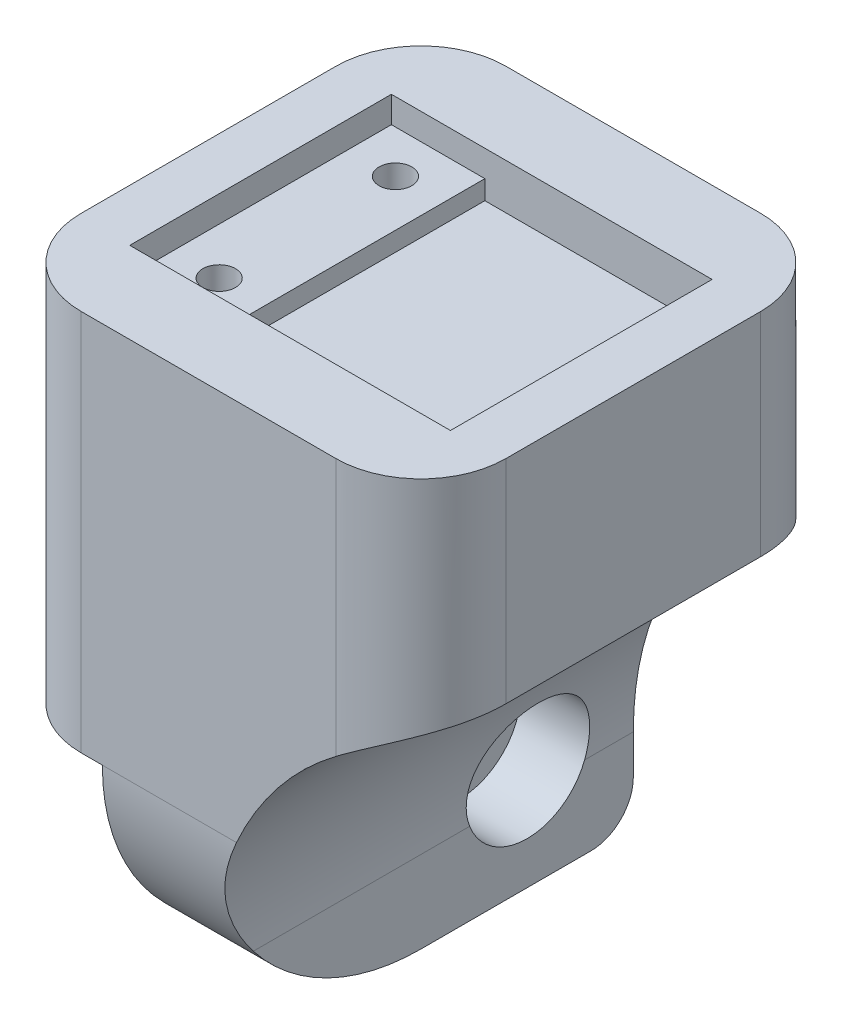
ISO-10303-21;
HEADER;
FILE_DESCRIPTION(('STEP AP214'),'2;1');
FILE_NAME('part.step','',(''),(''),'','','');
FILE_SCHEMA(('AUTOMOTIVE_DESIGN { 1 0 10303 214 1 1 1 1 }'));
ENDSEC;
DATA;
#1=APPLICATION_CONTEXT('core data for automotive mechanical design processes');
#2=APPLICATION_PROTOCOL_DEFINITION('international standard','automotive_design',2000,#1);
#3=PRODUCT_CONTEXT('',#1,'mechanical');
#4=PRODUCT('Part','Part','',(#3));
#5=PRODUCT_RELATED_PRODUCT_CATEGORY('part','',(#4));
#6=PRODUCT_DEFINITION_FORMATION('','',#4);
#7=PRODUCT_DEFINITION_CONTEXT('part definition',#1,'design');
#8=PRODUCT_DEFINITION('design','',#6,#7);
#9=PRODUCT_DEFINITION_SHAPE('','',#8);
#10=(LENGTH_UNIT() NAMED_UNIT(*) SI_UNIT(.MILLI.,.METRE.));
#11=(NAMED_UNIT(*) PLANE_ANGLE_UNIT() SI_UNIT($,.RADIAN.));
#12=(NAMED_UNIT(*) SI_UNIT($,.STERADIAN.) SOLID_ANGLE_UNIT());
#13=UNCERTAINTY_MEASURE_WITH_UNIT(LENGTH_MEASURE(1.E-05),#10,'distance_accuracy_value','');
#14=(GEOMETRIC_REPRESENTATION_CONTEXT(3) GLOBAL_UNCERTAINTY_ASSIGNED_CONTEXT((#13)) GLOBAL_UNIT_ASSIGNED_CONTEXT((#10,
#11,#12)) REPRESENTATION_CONTEXT('',''));
#15=CARTESIAN_POINT('',(0.,0.,0.));
#16=DIRECTION('',(0.,0.,1.));
#17=DIRECTION('',(1.,0.,0.));
#18=AXIS2_PLACEMENT_3D('',#15,#16,#17);
#19=CARTESIAN_POINT('',(6.35000000000001,-6.477,-6.35));
#20=DIRECTION('',(-1.,0.,0.));
#21=DIRECTION('',(0.,-1.,0.));
#22=AXIS2_PLACEMENT_3D('',#19,#20,#21);
#23=CYLINDRICAL_SURFACE('',#22,2.159);
#24=CARTESIAN_POINT('',(0.,-6.477,-6.35));
#25=DIRECTION('',(-1.,0.,0.));
#26=DIRECTION('',(0.,-1.,0.));
#27=AXIS2_PLACEMENT_3D('',#24,#25,#26);
#28=CIRCLE('',#27,2.159);
#29=CARTESIAN_POINT('',(0.,-8.636,-6.35));
#30=VERTEX_POINT('',#29);
#31=EDGE_CURVE('E251',#30,#30,#28,.T.);
#32=ORIENTED_EDGE('',*,*,#31,.T.);
#33=EDGE_LOOP('',(#32));
#34=FACE_BOUND('',#33,.T.);
#35=CARTESIAN_POINT('',(2.286,-6.477,-6.35));
#36=DIRECTION('',(1.,0.,0.));
#37=DIRECTION('',(0.,1.,0.));
#38=AXIS2_PLACEMENT_3D('',#35,#36,#37);
#39=CIRCLE('',#38,2.159);
#40=CARTESIAN_POINT('',(2.286,-4.318,-6.35));
#41=VERTEX_POINT('',#40);
#42=EDGE_CURVE('E244',#41,#41,#39,.T.);
#43=ORIENTED_EDGE('',*,*,#42,.T.);
#44=EDGE_LOOP('',(#43));
#45=FACE_BOUND('',#44,.T.);
#46=ADVANCED_FACE('F37',(#34,#45),#23,.F.);
#47=CARTESIAN_POINT('',(6.35,0.,12.7));
#48=DIRECTION('',(1.,0.,0.));
#49=DIRECTION('',(0.,1.,0.));
#50=AXIS2_PLACEMENT_3D('',#47,#48,#49);
#51=PLANE('',#50);
#52=DIRECTION('',(0.,0.,-1.));
#53=VECTOR('',#52,1.);
#54=CARTESIAN_POINT('',(6.35,-12.7,12.7));
#55=LINE('',#54,#53);
#56=CARTESIAN_POINT('',(6.35,-12.7,0.));
#57=VERTEX_POINT('',#56);
#58=CARTESIAN_POINT('',(6.35,-12.7,-10.16));
#59=VERTEX_POINT('',#58);
#60=EDGE_CURVE('E264',#57,#59,#55,.T.);
#61=ORIENTED_EDGE('',*,*,#60,.T.);
#62=CARTESIAN_POINT('',(6.35,-10.16,-10.16));
#63=DIRECTION('',(1.,0.,0.));
#64=DIRECTION('',(0.,1.,0.));
#65=AXIS2_PLACEMENT_3D('',#62,#63,#64);
#66=CIRCLE('',#65,2.54);
#67=CARTESIAN_POINT('',(6.35,-10.16,-12.7));
#68=VERTEX_POINT('',#67);
#69=EDGE_CURVE('E59',#59,#68,#66,.T.);
#70=ORIENTED_EDGE('',*,*,#69,.T.);
#71=DIRECTION('',(0.,-1.,0.));
#72=VECTOR('',#71,1.);
#73=CARTESIAN_POINT('',(6.35,0.,-12.7));
#74=LINE('',#73,#72);
#75=CARTESIAN_POINT('',(6.35,-7.80051224213831,-12.7));
#76=VERTEX_POINT('',#75);
#77=EDGE_CURVE('E256',#76,#68,#74,.T.);
#78=ORIENTED_EDGE('',*,*,#77,.F.);
#79=DIRECTION('',(0.,0.,1.));
#80=VECTOR('',#79,1.);
#81=CARTESIAN_POINT('',(6.35,-7.80051224213831,12.7));
#82=LINE('',#81,#80);
#83=CARTESIAN_POINT('',(6.35,-7.80051224213831,-9.78697604660115));
#84=VERTEX_POINT('',#83);
#85=EDGE_CURVE('E288',#76,#84,#82,.T.);
#86=ORIENTED_EDGE('',*,*,#85,.T.);
#87=CARTESIAN_POINT('',(6.35,-6.477,-6.35));
#88=DIRECTION('',(1.,0.,0.));
#89=DIRECTION('',(0.,1.,0.));
#90=AXIS2_PLACEMENT_3D('',#87,#88,#89);
#91=CIRCLE('',#90,3.683);
#92=CARTESIAN_POINT('',(6.35,-7.80051224213831,-2.91302395339885));
#93=VERTEX_POINT('',#92);
#94=EDGE_CURVE('E247',#93,#84,#91,.T.);
#95=ORIENTED_EDGE('',*,*,#94,.F.);
#96=DIRECTION('',(0.,0.,1.));
#97=VECTOR('',#96,1.);
#98=CARTESIAN_POINT('',(6.35,-7.80051224213831,12.7));
#99=LINE('',#98,#97);
#100=CARTESIAN_POINT('',(6.35,-7.80051224213831,10.0220760703684));
#101=VERTEX_POINT('',#100);
#102=EDGE_CURVE('E285',#93,#101,#99,.T.);
#103=ORIENTED_EDGE('',*,*,#102,.T.);
#104=CARTESIAN_POINT('',(6.35,0.,0.));
#105=DIRECTION('',(1.,0.,0.));
#106=DIRECTION('',(0.,1.,0.));
#107=AXIS2_PLACEMENT_3D('',#104,#105,#106);
#108=CIRCLE('',#107,12.7);
#109=EDGE_CURVE('E361',#101,#57,#108,.T.);
#110=ORIENTED_EDGE('',*,*,#109,.T.);
#111=EDGE_LOOP('',(#61,#70,#78,#86,#95,#103,#110));
#112=FACE_BOUND('',#111,.T.);
#113=ADVANCED_FACE('F314',(#112),#51,.T.);
#114=CARTESIAN_POINT('',(0.,22.86,12.7));
#115=DIRECTION('',(0.,1.,0.));
#116=DIRECTION('',(0.,0.,1.));
#117=AXIS2_PLACEMENT_3D('',#114,#115,#116);
#118=PLANE('',#117);
#119=DIRECTION('',(0.,0.,1.));
#120=VECTOR('',#119,1.);
#121=CARTESIAN_POINT('',(-3.23850000000001,22.86,-7.8232));
#122=LINE('',#121,#120);
#123=CARTESIAN_POINT('',(-3.23850000000001,22.86,-7.8232));
#124=VERTEX_POINT('',#123);
#125=CARTESIAN_POINT('',(-3.23850000000001,22.86,7.8232));
#126=VERTEX_POINT('',#125);
#127=EDGE_CURVE('E212',#124,#126,#122,.T.);
#128=ORIENTED_EDGE('',*,*,#127,.F.);
#129=DIRECTION('',(-1.,0.,0.));
#130=VECTOR('',#129,1.);
#131=CARTESIAN_POINT('',(-3.23850000000001,22.86,-7.8232));
#132=LINE('',#131,#130);
#133=CARTESIAN_POINT('',(15.9385,22.86,-7.8232));
#134=VERTEX_POINT('',#133);
#135=EDGE_CURVE('E218',#134,#124,#132,.T.);
#136=ORIENTED_EDGE('',*,*,#135,.F.);
#137=DIRECTION('',(0.,0.,-1.));
#138=VECTOR('',#137,1.);
#139=CARTESIAN_POINT('',(15.9385,22.86,-7.8232));
#140=LINE('',#139,#138);
#141=CARTESIAN_POINT('',(15.9385,22.86,7.8232));
#142=VERTEX_POINT('',#141);
#143=EDGE_CURVE('E226',#142,#134,#140,.T.);
#144=ORIENTED_EDGE('',*,*,#143,.F.);
#145=DIRECTION('',(1.,0.,0.));
#146=VECTOR('',#145,1.);
#147=CARTESIAN_POINT('',(-3.23850000000001,22.86,7.8232));
#148=LINE('',#147,#146);
#149=EDGE_CURVE('E224',#126,#142,#148,.T.);
#150=ORIENTED_EDGE('',*,*,#149,.F.);
#151=EDGE_LOOP('',(#128,#136,#144,#150));
#152=FACE_BOUND('',#151,.T.);
#153=DIRECTION('',(1.,0.,0.));
#154=VECTOR('',#153,1.);
#155=CARTESIAN_POINT('',(0.,22.86,-12.7));
#156=LINE('',#155,#154);
#157=CARTESIAN_POINT('',(-1.27000000000001,22.86,-12.7));
#158=VERTEX_POINT('',#157);
#159=CARTESIAN_POINT('',(13.97,22.86,-12.7));
#160=VERTEX_POINT('',#159);
#161=EDGE_CURVE('E266',#158,#160,#156,.T.);
#162=ORIENTED_EDGE('',*,*,#161,.F.);
#163=CARTESIAN_POINT('',(-1.27000000000001,22.86,-7.62));
#164=DIRECTION('',(0.,1.,0.));
#165=DIRECTION('',(0.,0.,1.));
#166=AXIS2_PLACEMENT_3D('',#163,#164,#165);
#167=CIRCLE('',#166,5.08);
#168=CARTESIAN_POINT('',(-6.35000000000001,22.86,-7.62));
#169=VERTEX_POINT('',#168);
#170=EDGE_CURVE('E429',#158,#169,#167,.T.);
#171=ORIENTED_EDGE('',*,*,#170,.T.);
#172=DIRECTION('',(0.,0.,-1.));
#173=VECTOR('',#172,1.);
#174=CARTESIAN_POINT('',(-6.35000000000001,22.86,12.7));
#175=LINE('',#174,#173);
#176=CARTESIAN_POINT('',(-6.35000000000001,22.86,7.62));
#177=VERTEX_POINT('',#176);
#178=EDGE_CURVE('E282',#177,#169,#175,.T.);
#179=ORIENTED_EDGE('',*,*,#178,.F.);
#180=CARTESIAN_POINT('',(-1.27000000000001,22.86,7.62));
#181=DIRECTION('',(0.,1.,0.));
#182=DIRECTION('',(0.,0.,1.));
#183=AXIS2_PLACEMENT_3D('',#180,#181,#182);
#184=CIRCLE('',#183,5.08);
#185=CARTESIAN_POINT('',(-1.27000000000001,22.86,12.7));
#186=VERTEX_POINT('',#185);
#187=EDGE_CURVE('E444',#177,#186,#184,.T.);
#188=ORIENTED_EDGE('',*,*,#187,.T.);
#189=DIRECTION('',(1.,0.,0.));
#190=VECTOR('',#189,1.);
#191=CARTESIAN_POINT('',(0.,22.86,12.7));
#192=LINE('',#191,#190);
#193=CARTESIAN_POINT('',(13.97,22.86,12.7));
#194=VERTEX_POINT('',#193);
#195=EDGE_CURVE('E257',#186,#194,#192,.T.);
#196=ORIENTED_EDGE('',*,*,#195,.T.);
#197=CARTESIAN_POINT('',(13.97,22.86,7.62));
#198=DIRECTION('',(0.,1.,0.));
#199=DIRECTION('',(0.,0.,1.));
#200=AXIS2_PLACEMENT_3D('',#197,#198,#199);
#201=CIRCLE('',#200,5.08);
#202=CARTESIAN_POINT('',(19.05,22.86,7.62));
#203=VERTEX_POINT('',#202);
#204=EDGE_CURVE('E456',#194,#203,#201,.T.);
#205=ORIENTED_EDGE('',*,*,#204,.T.);
#206=DIRECTION('',(0.,0.,1.));
#207=VECTOR('',#206,1.);
#208=CARTESIAN_POINT('',(19.05,22.86,12.7));
#209=LINE('',#208,#207);
#210=CARTESIAN_POINT('',(19.05,22.86,-7.62));
#211=VERTEX_POINT('',#210);
#212=EDGE_CURVE('E241',#211,#203,#209,.T.);
#213=ORIENTED_EDGE('',*,*,#212,.F.);
#214=CARTESIAN_POINT('',(13.97,22.86,-7.62));
#215=DIRECTION('',(0.,1.,0.));
#216=DIRECTION('',(0.,0.,1.));
#217=AXIS2_PLACEMENT_3D('',#214,#215,#216);
#218=CIRCLE('',#217,5.08);
#219=EDGE_CURVE('E431',#211,#160,#218,.T.);
#220=ORIENTED_EDGE('',*,*,#219,.T.);
#221=EDGE_LOOP('',(#162,#171,#179,#188,#196,#205,#213,#220));
#222=FACE_BOUND('',#221,.T.);
#223=ADVANCED_FACE('F396',(#152,#222),#118,.T.);
#224=CARTESIAN_POINT('',(-6.35,0.,12.7));
#225=DIRECTION('',(1.,0.,0.));
#226=DIRECTION('',(0.,1.,0.));
#227=AXIS2_PLACEMENT_3D('',#224,#225,#226);
#228=PLANE('',#227);
#229=ORIENTED_EDGE('',*,*,#178,.T.);
#230=DIRECTION('',(0.,-1.,0.));
#231=VECTOR('',#230,1.);
#232=CARTESIAN_POINT('',(-6.35,0.,-7.62));
#233=LINE('',#232,#231);
#234=CARTESIAN_POINT('',(-6.35,0.,-7.62));
#235=VERTEX_POINT('',#234);
#236=EDGE_CURVE('E438',#169,#235,#233,.T.);
#237=ORIENTED_EDGE('',*,*,#236,.T.);
#238=DIRECTION('',(0.,0.,-1.));
#239=VECTOR('',#238,1.);
#240=CARTESIAN_POINT('',(-6.35,0.,12.7));
#241=LINE('',#240,#239);
#242=CARTESIAN_POINT('',(-6.35,0.,7.62));
#243=VERTEX_POINT('',#242);
#244=EDGE_CURVE('E279',#243,#235,#241,.T.);
#245=ORIENTED_EDGE('',*,*,#244,.F.);
#246=DIRECTION('',(0.,-1.,0.));
#247=VECTOR('',#246,1.);
#248=CARTESIAN_POINT('',(-6.35000000000001,22.86,7.62));
#249=LINE('',#248,#247);
#250=EDGE_CURVE('E473',#243,#177,#249,.F.);
#251=ORIENTED_EDGE('',*,*,#250,.T.);
#252=EDGE_LOOP('',(#229,#237,#245,#251));
#253=FACE_BOUND('',#252,.T.);
#254=ADVANCED_FACE('F414',(#253),#228,.F.);
#255=CARTESIAN_POINT('',(0.,0.,12.7));
#256=DIRECTION('',(0.,1.,0.));
#257=DIRECTION('',(-1.,0.,0.));
#258=AXIS2_PLACEMENT_3D('',#255,#256,#257);
#259=PLANE('',#258);
#260=ORIENTED_EDGE('',*,*,#244,.T.);
#261=CARTESIAN_POINT('',(-1.27,0.,-7.62));
#262=DIRECTION('',(0.,1.,0.));
#263=DIRECTION('',(-1.,0.,0.));
#264=AXIS2_PLACEMENT_3D('',#261,#262,#263);
#265=CIRCLE('',#264,5.08);
#266=CARTESIAN_POINT('',(-1.27,0.,-12.7));
#267=VERTEX_POINT('',#266);
#268=EDGE_CURVE('E467',#235,#267,#265,.F.);
#269=ORIENTED_EDGE('',*,*,#268,.T.);
#270=DIRECTION('',(1.,0.,0.));
#271=VECTOR('',#270,1.);
#272=CARTESIAN_POINT('',(0.,0.,-12.7));
#273=LINE('',#272,#271);
#274=CARTESIAN_POINT('',(0.,0.,-12.7));
#275=VERTEX_POINT('',#274);
#276=EDGE_CURVE('E269',#267,#275,#273,.T.);
#277=ORIENTED_EDGE('',*,*,#276,.T.);
#278=DIRECTION('',(0.,0.,-1.));
#279=VECTOR('',#278,1.);
#280=CARTESIAN_POINT('',(0.,0.,12.7));
#281=LINE('',#280,#279);
#282=CARTESIAN_POINT('',(0.,0.,12.7));
#283=VERTEX_POINT('',#282);
#284=EDGE_CURVE('E276',#283,#275,#281,.T.);
#285=ORIENTED_EDGE('',*,*,#284,.F.);
#286=DIRECTION('',(1.,0.,0.));
#287=VECTOR('',#286,1.);
#288=CARTESIAN_POINT('',(0.,0.,12.7));
#289=LINE('',#288,#287);
#290=CARTESIAN_POINT('',(-1.27,0.,12.7));
#291=VERTEX_POINT('',#290);
#292=EDGE_CURVE('E260',#291,#283,#289,.T.);
#293=ORIENTED_EDGE('',*,*,#292,.F.);
#294=CARTESIAN_POINT('',(-1.27,0.,7.62));
#295=DIRECTION('',(0.,1.,0.));
#296=DIRECTION('',(-1.,0.,0.));
#297=AXIS2_PLACEMENT_3D('',#294,#295,#296);
#298=CIRCLE('',#297,5.08);
#299=EDGE_CURVE('E472',#291,#243,#298,.F.);
#300=ORIENTED_EDGE('',*,*,#299,.T.);
#301=EDGE_LOOP('',(#260,#269,#277,#285,#293,#300));
#302=FACE_BOUND('',#301,.T.);
#303=ADVANCED_FACE('F410',(#302),#259,.F.);
#304=CARTESIAN_POINT('',(0.,0.,12.7));
#305=DIRECTION('',(1.,0.,0.));
#306=DIRECTION('',(0.,1.,0.));
#307=AXIS2_PLACEMENT_3D('',#304,#305,#306);
#308=PLANE('',#307);
#309=ORIENTED_EDGE('',*,*,#31,.F.);
#310=EDGE_LOOP('',(#309));
#311=FACE_BOUND('',#310,.T.);
#312=DIRECTION('',(0.,-1.,0.));
#313=VECTOR('',#312,1.);
#314=CARTESIAN_POINT('',(0.,0.,-12.7));
#315=LINE('',#314,#313);
#316=CARTESIAN_POINT('',(0.,-10.16,-12.7));
#317=VERTEX_POINT('',#316);
#318=EDGE_CURVE('E261',#275,#317,#315,.T.);
#319=ORIENTED_EDGE('',*,*,#318,.T.);
#320=CARTESIAN_POINT('',(0.,-10.16,-10.16));
#321=DIRECTION('',(1.,0.,0.));
#322=DIRECTION('',(0.,1.,0.));
#323=AXIS2_PLACEMENT_3D('',#320,#321,#322);
#324=CIRCLE('',#323,2.54);
#325=CARTESIAN_POINT('',(0.,-12.7,-10.16));
#326=VERTEX_POINT('',#325);
#327=EDGE_CURVE('E11',#317,#326,#324,.F.);
#328=ORIENTED_EDGE('',*,*,#327,.T.);
#329=DIRECTION('',(0.,0.,-1.));
#330=VECTOR('',#329,1.);
#331=CARTESIAN_POINT('',(0.,-12.7,12.7));
#332=LINE('',#331,#330);
#333=CARTESIAN_POINT('',(0.,-12.7,0.));
#334=VERTEX_POINT('',#333);
#335=EDGE_CURVE('E273',#334,#326,#332,.T.);
#336=ORIENTED_EDGE('',*,*,#335,.F.);
#337=CARTESIAN_POINT('',(0.,0.,0.));
#338=DIRECTION('',(1.,0.,0.));
#339=DIRECTION('',(0.,1.,0.));
#340=AXIS2_PLACEMENT_3D('',#337,#338,#339);
#341=CIRCLE('',#340,12.7);
#342=EDGE_CURVE('E366',#334,#283,#341,.F.);
#343=ORIENTED_EDGE('',*,*,#342,.T.);
#344=ORIENTED_EDGE('',*,*,#284,.T.);
#345=EDGE_LOOP('',(#319,#328,#336,#343,#344));
#346=FACE_BOUND('',#345,.T.);
#347=ADVANCED_FACE('F386',(#311,#346),#308,.F.);
#348=CARTESIAN_POINT('',(0.,-12.7,12.7));
#349=DIRECTION('',(0.,1.,0.));
#350=DIRECTION('',(-1.,0.,0.));
#351=AXIS2_PLACEMENT_3D('',#348,#349,#350);
#352=PLANE('',#351);
#353=ORIENTED_EDGE('',*,*,#335,.T.);
#354=DIRECTION('',(1.,0.,0.));
#355=VECTOR('',#354,1.);
#356=CARTESIAN_POINT('',(0.,-12.7,-10.16));
#357=LINE('',#356,#355);
#358=EDGE_CURVE('E368',#326,#59,#357,.T.);
#359=ORIENTED_EDGE('',*,*,#358,.T.);
#360=ORIENTED_EDGE('',*,*,#60,.F.);
#361=DIRECTION('',(1.,0.,0.));
#362=VECTOR('',#361,1.);
#363=CARTESIAN_POINT('',(0.,-12.7,0.));
#364=LINE('',#363,#362);
#365=EDGE_CURVE('E364',#57,#334,#364,.F.);
#366=ORIENTED_EDGE('',*,*,#365,.T.);
#367=EDGE_LOOP('',(#353,#359,#360,#366));
#368=FACE_BOUND('',#367,.T.);
#369=ADVANCED_FACE('F374',(#368),#352,.F.);
#370=CARTESIAN_POINT('',(0.,0.,12.7));
#371=DIRECTION('',(0.,0.,1.));
#372=DIRECTION('',(1.,0.,0.));
#373=AXIS2_PLACEMENT_3D('',#370,#371,#372);
#374=PLANE('',#373);
#375=ORIENTED_EDGE('',*,*,#292,.T.);
#376=DIRECTION('',(1.,0.,0.));
#377=VECTOR('',#376,1.);
#378=CARTESIAN_POINT('',(6.35000000000001,0.,12.7));
#379=LINE('',#378,#377);
#380=CARTESIAN_POINT('',(8.0202845604351,0.,12.7));
#381=VERTEX_POINT('',#380);
#382=EDGE_CURVE('E362',#283,#381,#379,.T.);
#383=ORIENTED_EDGE('',*,*,#382,.T.);
#384=CARTESIAN_POINT('',(25.4,-7.8005122421383,12.7));
#385=DIRECTION('',(0.,0.,1.));
#386=DIRECTION('',(1.,0.,0.));
#387=AXIS2_PLACEMENT_3D('',#384,#385,#386);
#388=CIRCLE('',#387,19.05);
#389=CARTESIAN_POINT('',(13.97,7.4394877578617,12.7));
#390=VERTEX_POINT('',#389);
#391=EDGE_CURVE('E300',#381,#390,#388,.F.);
#392=ORIENTED_EDGE('',*,*,#391,.T.);
#393=DIRECTION('',(0.,-1.,0.));
#394=VECTOR('',#393,1.);
#395=CARTESIAN_POINT('',(13.97,0.,12.7));
#396=LINE('',#395,#394);
#397=EDGE_CURVE('E336',#390,#194,#396,.F.);
#398=ORIENTED_EDGE('',*,*,#397,.T.);
#399=ORIENTED_EDGE('',*,*,#195,.F.);
#400=DIRECTION('',(0.,-1.,0.));
#401=VECTOR('',#400,1.);
#402=CARTESIAN_POINT('',(-1.27,0.,12.7));
#403=LINE('',#402,#401);
#404=EDGE_CURVE('E458',#186,#291,#403,.T.);
#405=ORIENTED_EDGE('',*,*,#404,.T.);
#406=EDGE_LOOP('',(#375,#383,#392,#398,#399,#405));
#407=FACE_BOUND('',#406,.T.);
#408=ADVANCED_FACE('F399',(#407),#374,.T.);
#409=CARTESIAN_POINT('',(0.,0.,-12.7));
#410=DIRECTION('',(0.,0.,1.));
#411=DIRECTION('',(1.,0.,0.));
#412=AXIS2_PLACEMENT_3D('',#409,#410,#411);
#413=PLANE('',#412);
#414=ORIENTED_EDGE('',*,*,#77,.T.);
#415=DIRECTION('',(1.,0.,0.));
#416=VECTOR('',#415,1.);
#417=CARTESIAN_POINT('',(0.,-10.16,-12.7));
#418=LINE('',#417,#416);
#419=EDGE_CURVE('E45',#68,#317,#418,.F.);
#420=ORIENTED_EDGE('',*,*,#419,.T.);
#421=ORIENTED_EDGE('',*,*,#318,.F.);
#422=ORIENTED_EDGE('',*,*,#276,.F.);
#423=DIRECTION('',(0.,-1.,0.));
#424=VECTOR('',#423,1.);
#425=CARTESIAN_POINT('',(-1.27,0.,-12.7));
#426=LINE('',#425,#424);
#427=EDGE_CURVE('E436',#267,#158,#426,.F.);
#428=ORIENTED_EDGE('',*,*,#427,.T.);
#429=ORIENTED_EDGE('',*,*,#161,.T.);
#430=DIRECTION('',(0.,1.,0.));
#431=VECTOR('',#430,1.);
#432=CARTESIAN_POINT('',(13.97,10.16,-12.7));
#433=LINE('',#432,#431);
#434=CARTESIAN_POINT('',(13.97,7.4394877578617,-12.7));
#435=VERTEX_POINT('',#434);
#436=EDGE_CURVE('E464',#160,#435,#433,.F.);
#437=ORIENTED_EDGE('',*,*,#436,.T.);
#438=CARTESIAN_POINT('',(25.4,-7.8005122421383,-12.7));
#439=DIRECTION('',(0.,0.,1.));
#440=DIRECTION('',(1.,0.,0.));
#441=AXIS2_PLACEMENT_3D('',#438,#439,#440);
#442=CIRCLE('',#441,19.05);
#443=EDGE_CURVE('E290',#435,#76,#442,.T.);
#444=ORIENTED_EDGE('',*,*,#443,.T.);
#445=EDGE_LOOP('',(#414,#420,#421,#422,#428,#429,#437,#444));
#446=FACE_BOUND('',#445,.T.);
#447=ADVANCED_FACE('F402',(#446),#413,.F.);
#448=CARTESIAN_POINT('',(2.286,-6.477,-6.35));
#449=DIRECTION('',(1.,0.,0.));
#450=DIRECTION('',(0.,1.,0.));
#451=AXIS2_PLACEMENT_3D('',#448,#449,#450);
#452=CYLINDRICAL_SURFACE('',#451,3.683);
#453=CARTESIAN_POINT('',(2.286,-6.477,-6.35));
#454=DIRECTION('',(1.,0.,0.));
#455=DIRECTION('',(0.,1.,0.));
#456=AXIS2_PLACEMENT_3D('',#453,#454,#455);
#457=CIRCLE('',#456,3.683);
#458=CARTESIAN_POINT('',(2.286,-2.794,-6.35));
#459=VERTEX_POINT('',#458);
#460=EDGE_CURVE('E248',#459,#459,#457,.T.);
#461=ORIENTED_EDGE('',*,*,#460,.F.);
#462=EDGE_LOOP('',(#461));
#463=FACE_BOUND('',#462,.T.);
#464=ORIENTED_EDGE('',*,*,#94,.T.);
#465=CARTESIAN_POINT('',(6.35,-7.80051224213831,-9.78697604660115));
#466=CARTESIAN_POINT('',(6.3499932072847,-7.70518619562024,-9.82369589744287));
#467=CARTESIAN_POINT('',(6.3507153291311,-7.60832823117715,-9.85642811391249));
#468=CARTESIAN_POINT('',(6.35370631729381,-7.41225683674622,-9.91373328164409));
#469=CARTESIAN_POINT('',(6.35597510111973,-7.31304353265153,-9.93830666794902));
#470=CARTESIAN_POINT('',(6.3621443019803,-7.11308938216757,-9.97908764705105));
#471=CARTESIAN_POINT('',(6.36604259707161,-7.01235068596767,-9.9953060585699));
#472=CARTESIAN_POINT('',(6.375499016466,-6.80998179432225,-10.0193336935418));
#473=CARTESIAN_POINT('',(6.38105711298575,-6.70835161382687,-10.0271430577432));
#474=CARTESIAN_POINT('',(6.40023371255697,-6.40310938836352,-10.0378706429127));
#475=CARTESIAN_POINT('',(6.41635727092941,-6.19905460426214,-10.0281068063345));
#476=CARTESIAN_POINT('',(6.4546654765816,-5.79604633874275,-9.97521220592292));
#477=CARTESIAN_POINT('',(6.47684977088027,-5.59709256097681,-9.93208338501939));
#478=CARTESIAN_POINT('',(6.52619273858322,-5.20809974484812,-9.81352399087587));
#479=CARTESIAN_POINT('',(6.55338612154299,-5.01813531789258,-9.73786278094376));
#480=CARTESIAN_POINT('',(6.6108078341255,-4.65363091359789,-9.55644518156167));
#481=CARTESIAN_POINT('',(6.64103704804404,-4.47909545850484,-9.45068000668959));
#482=CARTESIAN_POINT('',(6.70298153728171,-4.14629492881634,-9.20927926528496));
#483=CARTESIAN_POINT('',(6.7347148772453,-3.98847262164694,-9.07303737845573));
#484=CARTESIAN_POINT('',(6.79642887364752,-3.6978595818766,-8.77571314822963));
#485=CARTESIAN_POINT('',(6.82640952425889,-3.56506893249661,-8.61463072225044));
#486=CARTESIAN_POINT('',(6.88215047110164,-3.32762164942583,-8.27087825051073));
#487=CARTESIAN_POINT('',(6.907886471571,-3.22312492021382,-8.08809357563943));
#488=CARTESIAN_POINT('',(6.95248823260638,-3.0465500873193,-7.70670131287096));
#489=CARTESIAN_POINT('',(6.97135512275023,-2.97446665303524,-7.50809633306647));
#490=CARTESIAN_POINT('',(6.99995075621327,-2.86657371084573,-7.10600638748597));
#491=CARTESIAN_POINT('',(7.00989725495566,-2.82989804724198,-6.90276952997625));
#492=CARTESIAN_POINT('',(7.02044932044491,-2.79101686716164,-6.49280155485421));
#493=CARTESIAN_POINT('',(7.02105667332611,-2.78880475944519,-6.28607111297003));
#494=CARTESIAN_POINT('',(7.01298404883436,-2.81850970520414,-5.8808276974865));
#495=CARTESIAN_POINT('',(7.00455078372029,-2.84952012432668,-5.68224244319343));
#496=CARTESIAN_POINT('',(6.97959477738464,-2.94319859243538,-5.29322678499275));
#497=CARTESIAN_POINT('',(6.96307167800441,-3.00586804305566,-5.1027967425442));
#498=CARTESIAN_POINT('',(6.92332243724394,-3.16140319327506,-4.73394102453503));
#499=CARTESIAN_POINT('',(6.90005167906195,-3.25447042428585,-4.55560533414103));
#500=CARTESIAN_POINT('',(6.84889598831357,-3.46795501221634,-4.2168719778773));
#501=CARTESIAN_POINT('',(6.82101032830188,-3.58837668212314,-4.05647714670938));
#502=CARTESIAN_POINT('',(6.76201795090239,-3.85746351435503,-3.75290229557159));
#503=CARTESIAN_POINT('',(6.73083826386592,-4.00688731685883,-3.6104085290234));
#504=CARTESIAN_POINT('',(6.66856178259532,-4.32742380311477,-3.35230721324836));
#505=CARTESIAN_POINT('',(6.63746499980611,-4.49853933764069,-3.23670320360225));
#506=CARTESIAN_POINT('',(6.57723565533644,-4.86106855003131,-3.03380900583331));
#507=CARTESIAN_POINT('',(6.54814539212603,-5.05277745908596,-2.94703270559038));
#508=CARTESIAN_POINT('',(6.49466548822156,-5.44876962200758,-2.80721818567139));
#509=CARTESIAN_POINT('',(6.47027572441193,-5.65305254635074,-2.75417908226626));
#510=CARTESIAN_POINT('',(6.42804869502356,-6.06557637732429,-2.6841529703026));
#511=CARTESIAN_POINT('',(6.41012990539457,-6.27373057903828,-2.6667035324588));
#512=CARTESIAN_POINT('',(6.38122809686976,-6.69041437832726,-2.66730344517256));
#513=CARTESIAN_POINT('',(6.37023962199593,-6.89894355066331,-2.68532482470168));
#514=CARTESIAN_POINT('',(6.35837361399868,-7.22327064310926,-2.74137579876414));
#515=CARTESIAN_POINT('',(6.35518664695592,-7.34111591223147,-2.7677739794301));
#516=CARTESIAN_POINT('',(6.35099699371923,-7.57350121751872,-2.83194880781064));
#517=CARTESIAN_POINT('',(6.34999078214324,-7.68804629244744,-2.86970697838323));
#518=CARTESIAN_POINT('',(6.35,-7.80051224213831,-2.91302395339885));
#519=B_SPLINE_CURVE_WITH_KNOTS('',3,(#465,#466,#467,#468,#469,#470,#471,#472,#473,#474,#475,
#476,#477,#478,#479,#480,#481,#482,#483,#484,#485,#486,#487,#488,#489,#490,#491,#492,#493,#494,
#495,#496,#497,#498,#499,#500,#501,#502,#503,#504,#505,#506,#507,#508,#509,#510,#511,#512,#513,
#514,#515,#516,#517,#518),.UNSPECIFIED.,.F.,.F.,(4,2,2,2,2,2,2,2,2,2,2,2,2,2,2,2,2,2,2,2,2,2,2,
2,2,2,4),(0.,0.306363439106133,0.612710539758788,0.918659953051379,1.22460424536282,
1.83621751997945,2.4477951814435,3.06378199102805,3.67994875241038,4.30968002909535,
4.9394133993657,5.57263477938169,6.20575198342599,6.82295674479883,7.44004346279299,
8.04070907232122,8.64140127733159,9.24615965950295,9.85101346047609,10.4745833061032,
11.0982351877384,11.7324725810508,12.3666933601464,12.9926195897961,13.6180524339691,
13.9799322800358,14.3412266779406),.UNSPECIFIED.);
#520=EDGE_CURVE('E292',#84,#93,#519,.T.);
#521=ORIENTED_EDGE('',*,*,#520,.T.);
#522=EDGE_LOOP('',(#464,#521));
#523=FACE_BOUND('',#522,.T.);
#524=ADVANCED_FACE('F302',(#463,#523),#452,.F.);
#525=CARTESIAN_POINT('',(2.286,-6.477,-6.35));
#526=DIRECTION('',(1.,0.,0.));
#527=DIRECTION('',(0.,1.,0.));
#528=AXIS2_PLACEMENT_3D('',#525,#526,#527);
#529=PLANE('',#528);
#530=ORIENTED_EDGE('',*,*,#42,.F.);
#531=EDGE_LOOP('',(#530));
#532=FACE_BOUND('',#531,.T.);
#533=ORIENTED_EDGE('',*,*,#460,.T.);
#534=EDGE_LOOP('',(#533));
#535=FACE_BOUND('',#534,.T.);
#536=ADVANCED_FACE('F484',(#532,#535),#529,.T.);
#537=CARTESIAN_POINT('',(19.05,0.,0.));
#538=DIRECTION('',(1.,0.,0.));
#539=DIRECTION('',(0.,1.,0.));
#540=AXIS2_PLACEMENT_3D('',#537,#538,#539);
#541=PLANE('',#540);
#542=DIRECTION('',(0.,0.,-1.));
#543=VECTOR('',#542,1.);
#544=CARTESIAN_POINT('',(19.05,10.16,12.7));
#545=LINE('',#544,#543);
#546=CARTESIAN_POINT('',(19.05,10.16,7.62));
#547=VERTEX_POINT('',#546);
#548=CARTESIAN_POINT('',(19.05,10.16,-7.62));
#549=VERTEX_POINT('',#548);
#550=EDGE_CURVE('E233',#547,#549,#545,.T.);
#551=ORIENTED_EDGE('',*,*,#550,.T.);
#552=DIRECTION('',(0.,1.,0.));
#553=VECTOR('',#552,1.);
#554=CARTESIAN_POINT('',(19.05,22.86,-7.62));
#555=LINE('',#554,#553);
#556=EDGE_CURVE('E442',#549,#211,#555,.T.);
#557=ORIENTED_EDGE('',*,*,#556,.T.);
#558=ORIENTED_EDGE('',*,*,#212,.T.);
#559=DIRECTION('',(0.,-1.,0.));
#560=VECTOR('',#559,1.);
#561=CARTESIAN_POINT('',(19.05,0.,7.62));
#562=LINE('',#561,#560);
#563=EDGE_CURVE('E439',#203,#547,#562,.T.);
#564=ORIENTED_EDGE('',*,*,#563,.T.);
#565=EDGE_LOOP('',(#551,#557,#558,#564));
#566=FACE_BOUND('',#565,.T.);
#567=ADVANCED_FACE('F477',(#566),#541,.T.);
#568=CARTESIAN_POINT('',(-3.23850000000001,21.2852,-7.8232));
#569=DIRECTION('',(-1.,0.,0.));
#570=DIRECTION('',(0.,0.,1.));
#571=AXIS2_PLACEMENT_3D('',#568,#569,#570);
#572=PLANE('',#571);
#573=ORIENTED_EDGE('',*,*,#127,.T.);
#574=DIRECTION('',(0.,1.,0.));
#575=VECTOR('',#574,1.);
#576=CARTESIAN_POINT('',(-3.23850000000001,21.2852,7.8232));
#577=LINE('',#576,#575);
#578=CARTESIAN_POINT('',(-3.23850000000001,21.2852,7.8232));
#579=VERTEX_POINT('',#578);
#580=EDGE_CURVE('E222',#579,#126,#577,.T.);
#581=ORIENTED_EDGE('',*,*,#580,.F.);
#582=DIRECTION('',(0.,0.,1.));
#583=VECTOR('',#582,1.);
#584=CARTESIAN_POINT('',(-3.23850000000001,21.2852,-7.8232));
#585=LINE('',#584,#583);
#586=CARTESIAN_POINT('',(-3.23850000000001,21.2852,-7.8232));
#587=VERTEX_POINT('',#586);
#588=EDGE_CURVE('E214',#587,#579,#585,.T.);
#589=ORIENTED_EDGE('',*,*,#588,.F.);
#590=DIRECTION('',(0.,1.,0.));
#591=VECTOR('',#590,1.);
#592=CARTESIAN_POINT('',(-3.23850000000001,21.2852,-7.8232));
#593=LINE('',#592,#591);
#594=EDGE_CURVE('E231',#587,#124,#593,.T.);
#595=ORIENTED_EDGE('',*,*,#594,.T.);
#596=EDGE_LOOP('',(#573,#581,#589,#595));
#597=FACE_BOUND('',#596,.T.);
#598=ADVANCED_FACE('F496',(#597),#572,.F.);
#599=CARTESIAN_POINT('',(-3.23850000000001,21.2852,-7.8232));
#600=DIRECTION('',(0.,0.,-1.));
#601=DIRECTION('',(-1.,0.,0.));
#602=AXIS2_PLACEMENT_3D('',#599,#600,#601);
#603=PLANE('',#602);
#604=ORIENTED_EDGE('',*,*,#135,.T.);
#605=ORIENTED_EDGE('',*,*,#594,.F.);
#606=DIRECTION('',(-1.,0.,0.));
#607=VECTOR('',#606,1.);
#608=CARTESIAN_POINT('',(-3.23850000000001,21.2852,-7.8232));
#609=LINE('',#608,#607);
#610=CARTESIAN_POINT('',(2.34949999999999,21.2852,-7.8232));
#611=VERTEX_POINT('',#610);
#612=EDGE_CURVE('E220',#611,#587,#609,.T.);
#613=ORIENTED_EDGE('',*,*,#612,.F.);
#614=DIRECTION('',(0.,1.,0.));
#615=VECTOR('',#614,1.);
#616=CARTESIAN_POINT('',(2.34949999999999,20.1422,-7.8232));
#617=LINE('',#616,#615);
#618=CARTESIAN_POINT('',(2.34949999999999,20.1422,-7.8232));
#619=VERTEX_POINT('',#618);
#620=EDGE_CURVE('E188',#619,#611,#617,.T.);
#621=ORIENTED_EDGE('',*,*,#620,.F.);
#622=DIRECTION('',(-1.,0.,0.));
#623=VECTOR('',#622,1.);
#624=CARTESIAN_POINT('',(2.34949999999999,20.1422,-7.8232));
#625=LINE('',#624,#623);
#626=CARTESIAN_POINT('',(15.9385,20.1422,-7.8232));
#627=VERTEX_POINT('',#626);
#628=EDGE_CURVE('E189',#627,#619,#625,.T.);
#629=ORIENTED_EDGE('',*,*,#628,.F.);
#630=DIRECTION('',(0.,1.,0.));
#631=VECTOR('',#630,1.);
#632=CARTESIAN_POINT('',(15.9385,21.2852,-7.8232));
#633=LINE('',#632,#631);
#634=EDGE_CURVE('E234',#627,#134,#633,.T.);
#635=ORIENTED_EDGE('',*,*,#634,.T.);
#636=EDGE_LOOP('',(#604,#605,#613,#621,#629,#635));
#637=FACE_BOUND('',#636,.T.);
#638=ADVANCED_FACE('F502',(#637),#603,.F.);
#639=CARTESIAN_POINT('',(15.9385,21.2852,-7.8232));
#640=DIRECTION('',(1.,0.,0.));
#641=DIRECTION('',(0.,0.,-1.));
#642=AXIS2_PLACEMENT_3D('',#639,#640,#641);
#643=PLANE('',#642);
#644=ORIENTED_EDGE('',*,*,#143,.T.);
#645=ORIENTED_EDGE('',*,*,#634,.F.);
#646=DIRECTION('',(0.,0.,-1.));
#647=VECTOR('',#646,1.);
#648=CARTESIAN_POINT('',(15.9385,20.1422,-7.8232));
#649=LINE('',#648,#647);
#650=CARTESIAN_POINT('',(15.9385,20.1422,7.8232));
#651=VERTEX_POINT('',#650);
#652=EDGE_CURVE('E199',#651,#627,#649,.T.);
#653=ORIENTED_EDGE('',*,*,#652,.F.);
#654=DIRECTION('',(0.,1.,0.));
#655=VECTOR('',#654,1.);
#656=CARTESIAN_POINT('',(15.9385,21.2852,7.8232));
#657=LINE('',#656,#655);
#658=EDGE_CURVE('E195',#651,#142,#657,.T.);
#659=ORIENTED_EDGE('',*,*,#658,.T.);
#660=EDGE_LOOP('',(#644,#645,#653,#659));
#661=FACE_BOUND('',#660,.T.);
#662=ADVANCED_FACE('F507',(#661),#643,.F.);
#663=CARTESIAN_POINT('',(-3.23850000000001,21.2852,7.8232));
#664=DIRECTION('',(0.,0.,1.));
#665=DIRECTION('',(1.,0.,0.));
#666=AXIS2_PLACEMENT_3D('',#663,#664,#665);
#667=PLANE('',#666);
#668=ORIENTED_EDGE('',*,*,#149,.T.);
#669=ORIENTED_EDGE('',*,*,#658,.F.);
#670=DIRECTION('',(1.,0.,0.));
#671=VECTOR('',#670,1.);
#672=CARTESIAN_POINT('',(2.34949999999999,20.1422,7.8232));
#673=LINE('',#672,#671);
#674=CARTESIAN_POINT('',(2.34949999999999,20.1422,7.8232));
#675=VERTEX_POINT('',#674);
#676=EDGE_CURVE('E192',#675,#651,#673,.T.);
#677=ORIENTED_EDGE('',*,*,#676,.F.);
#678=DIRECTION('',(0.,1.,0.));
#679=VECTOR('',#678,1.);
#680=CARTESIAN_POINT('',(2.34949999999999,20.1422,7.8232));
#681=LINE('',#680,#679);
#682=CARTESIAN_POINT('',(2.34949999999999,21.2852,7.8232));
#683=VERTEX_POINT('',#682);
#684=EDGE_CURVE('E177',#675,#683,#681,.T.);
#685=ORIENTED_EDGE('',*,*,#684,.T.);
#686=DIRECTION('',(1.,0.,0.));
#687=VECTOR('',#686,1.);
#688=CARTESIAN_POINT('',(-3.23850000000001,21.2852,7.8232));
#689=LINE('',#688,#687);
#690=EDGE_CURVE('E217',#579,#683,#689,.T.);
#691=ORIENTED_EDGE('',*,*,#690,.F.);
#692=ORIENTED_EDGE('',*,*,#580,.T.);
#693=EDGE_LOOP('',(#668,#669,#677,#685,#691,#692));
#694=FACE_BOUND('',#693,.T.);
#695=ADVANCED_FACE('F194',(#694),#667,.F.);
#696=CARTESIAN_POINT('',(0.,21.2852,0.));
#697=DIRECTION('',(0.,1.,0.));
#698=DIRECTION('',(0.,0.,1.));
#699=AXIS2_PLACEMENT_3D('',#696,#697,#698);
#700=PLANE('',#699);
#701=CARTESIAN_POINT('',(-0.444500000000014,21.2852,5.27049999999999));
#702=DIRECTION('',(0.,-1.,0.));
#703=DIRECTION('',(0.,0.,-1.));
#704=AXIS2_PLACEMENT_3D('',#701,#702,#703);
#705=CIRCLE('',#704,0.9779);
#706=CARTESIAN_POINT('',(-0.444500000000014,21.2852,4.29259999999999));
#707=VERTEX_POINT('',#706);
#708=EDGE_CURVE('E540',#707,#707,#705,.T.);
#709=ORIENTED_EDGE('',*,*,#708,.T.);
#710=EDGE_LOOP('',(#709));
#711=FACE_BOUND('',#710,.T.);
#712=CARTESIAN_POINT('',(-0.444500000000004,21.2852,-5.27050000000001));
#713=DIRECTION('',(0.,-1.,0.));
#714=DIRECTION('',(0.,0.,-1.));
#715=AXIS2_PLACEMENT_3D('',#712,#713,#714);
#716=CIRCLE('',#715,0.9779);
#717=CARTESIAN_POINT('',(-0.444500000000004,21.2852,-6.24840000000001));
#718=VERTEX_POINT('',#717);
#719=EDGE_CURVE('E543',#718,#718,#716,.T.);
#720=ORIENTED_EDGE('',*,*,#719,.T.);
#721=EDGE_LOOP('',(#720));
#722=FACE_BOUND('',#721,.T.);
#723=DIRECTION('',(0.,0.,1.));
#724=VECTOR('',#723,1.);
#725=CARTESIAN_POINT('',(2.34949999999999,21.2852,-7.8232));
#726=LINE('',#725,#724);
#727=EDGE_CURVE('E184',#611,#683,#726,.T.);
#728=ORIENTED_EDGE('',*,*,#727,.F.);
#729=ORIENTED_EDGE('',*,*,#612,.T.);
#730=ORIENTED_EDGE('',*,*,#588,.T.);
#731=ORIENTED_EDGE('',*,*,#690,.T.);
#732=EDGE_LOOP('',(#728,#729,#730,#731));
#733=FACE_BOUND('',#732,.T.);
#734=ADVANCED_FACE('F506',(#711,#722,#733),#700,.T.);
#735=CARTESIAN_POINT('',(2.34949999999999,20.1422,-7.8232));
#736=DIRECTION('',(-1.,0.,0.));
#737=DIRECTION('',(0.,0.,1.));
#738=AXIS2_PLACEMENT_3D('',#735,#736,#737);
#739=PLANE('',#738);
#740=ORIENTED_EDGE('',*,*,#727,.T.);
#741=ORIENTED_EDGE('',*,*,#684,.F.);
#742=DIRECTION('',(0.,0.,1.));
#743=VECTOR('',#742,1.);
#744=CARTESIAN_POINT('',(2.34949999999999,20.1422,-7.8232));
#745=LINE('',#744,#743);
#746=EDGE_CURVE('E181',#619,#675,#745,.T.);
#747=ORIENTED_EDGE('',*,*,#746,.F.);
#748=ORIENTED_EDGE('',*,*,#620,.T.);
#749=EDGE_LOOP('',(#740,#741,#747,#748));
#750=FACE_BOUND('',#749,.T.);
#751=ADVANCED_FACE('F179',(#750),#739,.F.);
#752=CARTESIAN_POINT('',(0.,20.1422,0.));
#753=DIRECTION('',(0.,1.,0.));
#754=DIRECTION('',(0.,0.,1.));
#755=AXIS2_PLACEMENT_3D('',#752,#753,#754);
#756=PLANE('',#755);
#757=ORIENTED_EDGE('',*,*,#746,.T.);
#758=ORIENTED_EDGE('',*,*,#676,.T.);
#759=ORIENTED_EDGE('',*,*,#652,.T.);
#760=ORIENTED_EDGE('',*,*,#628,.T.);
#761=EDGE_LOOP('',(#757,#758,#759,#760));
#762=FACE_BOUND('',#761,.T.);
#763=ADVANCED_FACE('F201',(#762),#756,.T.);
#764=CARTESIAN_POINT('',(-0.444500000000004,8.5852,-5.27050000000001));
#765=DIRECTION('',(0.,1.,0.));
#766=DIRECTION('',(0.,0.,1.));
#767=AXIS2_PLACEMENT_3D('',#764,#765,#766);
#768=CYLINDRICAL_SURFACE('',#767,0.9779);
#769=CARTESIAN_POINT('',(-0.444500000000004,8.5852,-5.27050000000001));
#770=DIRECTION('',(0.,-1.,0.));
#771=DIRECTION('',(0.,0.,-1.));
#772=AXIS2_PLACEMENT_3D('',#769,#770,#771);
#773=CIRCLE('',#772,0.9779);
#774=CARTESIAN_POINT('',(-0.444500000000004,8.5852,-6.24840000000001));
#775=VERTEX_POINT('',#774);
#776=EDGE_CURVE('E207',#775,#775,#773,.T.);
#777=ORIENTED_EDGE('',*,*,#776,.T.);
#778=EDGE_LOOP('',(#777));
#779=FACE_BOUND('',#778,.T.);
#780=ORIENTED_EDGE('',*,*,#719,.F.);
#781=EDGE_LOOP('',(#780));
#782=FACE_BOUND('',#781,.T.);
#783=ADVANCED_FACE('F521',(#779,#782),#768,.F.);
#784=CARTESIAN_POINT('',(-0.444500000000004,8.5852,-5.27050000000001));
#785=DIRECTION('',(0.,-1.,0.));
#786=DIRECTION('',(0.,0.,-1.));
#787=AXIS2_PLACEMENT_3D('',#784,#785,#786);
#788=PLANE('',#787);
#789=ORIENTED_EDGE('',*,*,#776,.F.);
#790=EDGE_LOOP('',(#789));
#791=FACE_BOUND('',#790,.T.);
#792=ADVANCED_FACE('F522',(#791),#788,.F.);
#793=CARTESIAN_POINT('',(-0.444500000000014,8.5852,5.27049999999999));
#794=DIRECTION('',(0.,1.,0.));
#795=DIRECTION('',(0.,0.,1.));
#796=AXIS2_PLACEMENT_3D('',#793,#794,#795);
#797=CYLINDRICAL_SURFACE('',#796,0.9779);
#798=CARTESIAN_POINT('',(-0.444500000000014,8.5852,5.27049999999999));
#799=DIRECTION('',(0.,-1.,0.));
#800=DIRECTION('',(0.,0.,-1.));
#801=AXIS2_PLACEMENT_3D('',#798,#799,#800);
#802=CIRCLE('',#801,0.9779);
#803=CARTESIAN_POINT('',(-0.444500000000014,8.5852,4.29259999999999));
#804=VERTEX_POINT('',#803);
#805=EDGE_CURVE('E204',#804,#804,#802,.T.);
#806=ORIENTED_EDGE('',*,*,#805,.T.);
#807=EDGE_LOOP('',(#806));
#808=FACE_BOUND('',#807,.T.);
#809=ORIENTED_EDGE('',*,*,#708,.F.);
#810=EDGE_LOOP('',(#809));
#811=FACE_BOUND('',#810,.T.);
#812=ADVANCED_FACE('F525',(#808,#811),#797,.F.);
#813=CARTESIAN_POINT('',(-0.444500000000014,8.5852,5.27049999999999));
#814=DIRECTION('',(0.,-1.,0.));
#815=DIRECTION('',(0.,0.,-1.));
#816=AXIS2_PLACEMENT_3D('',#813,#814,#815);
#817=PLANE('',#816);
#818=ORIENTED_EDGE('',*,*,#805,.F.);
#819=EDGE_LOOP('',(#818));
#820=FACE_BOUND('',#819,.T.);
#821=ADVANCED_FACE('F312',(#820),#817,.F.);
#822=CARTESIAN_POINT('',(25.4,-7.8005122421383,12.7));
#823=DIRECTION('',(0.,0.,-1.));
#824=DIRECTION('',(-1.,0.,0.));
#825=AXIS2_PLACEMENT_3D('',#822,#823,#824);
#826=CYLINDRICAL_SURFACE('',#825,19.05);
#827=ORIENTED_EDGE('',*,*,#391,.F.);
#828=CARTESIAN_POINT('',(8.0202845604351,0.,12.7));
#829=CARTESIAN_POINT('',(7.95623973943139,-0.142689930589859,12.7000004204589));
#830=CARTESIAN_POINT('',(7.89396092548907,-0.286157189861109,12.6975946343091));
#831=CARTESIAN_POINT('',(7.77300768967541,-0.574443090479567,12.6878217924169));
#832=CARTESIAN_POINT('',(7.71433344104883,-0.719261796396069,12.680454498415));
#833=CARTESIAN_POINT('',(7.54381862091162,-1.15546160929073,12.6506845076331));
#834=CARTESIAN_POINT('',(7.43750458923927,-1.44854491566182,12.6206136154773));
#835=CARTESIAN_POINT('',(7.24023386404369,-2.03669561778965,12.5391379419209));
#836=CARTESIAN_POINT('',(7.14926840047339,-2.33176177964383,12.4877454020029));
#837=CARTESIAN_POINT('',(6.98282078197014,-2.92159068190345,12.363055147179));
#838=CARTESIAN_POINT('',(6.90733566014301,-3.21635346965714,12.2897616363456));
#839=CARTESIAN_POINT('',(6.77151607107709,-3.80385800368776,12.1208227803598));
#840=CARTESIAN_POINT('',(6.71122318906108,-4.09659211455131,12.025117438703));
#841=CARTESIAN_POINT('',(6.60556153415684,-4.67665289749829,11.8116225221127));
#842=CARTESIAN_POINT('',(6.5601929276738,-4.96397950925462,11.693832700961));
#843=CARTESIAN_POINT('',(6.48360411774286,-5.53027117982313,11.4368979981633));
#844=CARTESIAN_POINT('',(6.45236099081433,-5.80924909508771,11.2977882104647));
#845=CARTESIAN_POINT('',(6.40278378246018,-6.35695925861672,10.998923976215));
#846=CARTESIAN_POINT('',(6.38444367071352,-6.62569623744085,10.8391792149466));
#847=CARTESIAN_POINT('',(6.3643386202554,-7.04503575647136,10.5684579528027));
#848=CARTESIAN_POINT('',(6.35887214015504,-7.19958213013918,10.463787295146));
#849=CARTESIAN_POINT('',(6.35170465363975,-7.50375652958391,10.2478478961992));
#850=CARTESIAN_POINT('',(6.34999832648477,-7.65339120961627,10.1365887072799));
#851=CARTESIAN_POINT('',(6.35,-7.80051224213831,10.0220760703684));
#852=B_SPLINE_CURVE_WITH_KNOTS('',3,(#828,#829,#830,#831,#832,#833,#834,#835,#836,#837,#838,
#839,#840,#841,#842,#843,#844,#845,#846,#847,#848,#849,#850,#851),.UNSPECIFIED.,.F.,.F.,(4,2,2,
2,2,2,2,2,2,2,2,4),(0.,0.4691505007505,0.938323532476189,1.87680562929807,2.8147496556707,
3.75251375147332,4.69281753531331,5.63313180315515,6.57191455937091,7.51025827643363,
8.07026811761367,8.62948501623367),.UNSPECIFIED.);
#853=EDGE_CURVE('E354',#381,#101,#852,.T.);
#854=ORIENTED_EDGE('',*,*,#853,.T.);
#855=ORIENTED_EDGE('',*,*,#102,.F.);
#856=ORIENTED_EDGE('',*,*,#520,.F.);
#857=ORIENTED_EDGE('',*,*,#85,.F.);
#858=ORIENTED_EDGE('',*,*,#443,.F.);
#859=CARTESIAN_POINT('',(13.97,7.43948775786169,-12.7));
#860=CARTESIAN_POINT('',(14.1140326883675,7.54753977716261,-12.7000047836035));
#861=CARTESIAN_POINT('',(14.2596745219039,7.65355350473613,-12.6938727823497));
#862=CARTESIAN_POINT('',(14.553296615294,7.8610219781395,-12.6685538735921));
#863=CARTESIAN_POINT('',(14.7012793757414,7.96247133131081,-12.6493519349189));
#864=CARTESIAN_POINT('',(14.9990213890594,8.16051233707464,-12.5969931338001));
#865=CARTESIAN_POINT('',(15.1487855968158,8.25708061204003,-12.5637751463123));
#866=CARTESIAN_POINT('',(15.4480230992322,8.444233227248,-12.4827006514639));
#867=CARTESIAN_POINT('',(15.5974964989476,8.53482041443858,-12.4348511705483));
#868=CARTESIAN_POINT('',(15.8719607171466,8.69616383578777,-12.3324314683308));
#869=CARTESIAN_POINT('',(15.9972107651253,8.76783824660714,-12.279997114043));
#870=CARTESIAN_POINT('',(16.2453407594578,8.90621962935055,-12.1640047534961));
#871=CARTESIAN_POINT('',(16.3682202385484,8.97292562921544,-12.1004445786001));
#872=CARTESIAN_POINT('',(16.610122673228,9.10094467035513,-11.9622931370843));
#873=CARTESIAN_POINT('',(16.7291534465295,9.16226914276028,-11.8877262014563));
#874=CARTESIAN_POINT('',(16.9623745017227,9.27947629636414,-11.7275664060683));
#875=CARTESIAN_POINT('',(17.0765652185589,9.33535946712521,-11.641974539851));
#876=CARTESIAN_POINT('',(17.2994342830865,9.44183892470484,-11.4595463696484));
#877=CARTESIAN_POINT('',(17.4080791448133,9.49240469293679,-11.362651246732));
#878=CARTESIAN_POINT('',(17.6178313926912,9.5878064067693,-11.1585211766839));
#879=CARTESIAN_POINT('',(17.7189418663099,9.6326447048322,-11.0512905066642));
#880=CARTESIAN_POINT('',(17.9124859626605,9.71664437609985,-10.8270479875621));
#881=CARTESIAN_POINT('',(18.0049130538345,9.75580148783147,-10.7100288988263));
#882=CARTESIAN_POINT('',(18.1798195881085,9.8284544737612,-10.4671407689282));
#883=CARTESIAN_POINT('',(18.2622999955226,9.86195089688002,-10.3412725875462));
#884=CARTESIAN_POINT('',(18.4097927397619,9.92081022904296,-10.0926003400461));
#885=CARTESIAN_POINT('',(18.4756901570232,9.94661982515588,-9.97042573636799));
#886=CARTESIAN_POINT('',(18.5975422834667,9.99368166995787,-9.7203792681442));
#887=CARTESIAN_POINT('',(18.6534976628683,10.0149342258692,-9.59250778836757));
#888=CARTESIAN_POINT('',(18.7548253626094,10.0529771837755,-9.33211690139589));
#889=CARTESIAN_POINT('',(18.8002064767992,10.0697712951671,-9.19960146252601));
#890=CARTESIAN_POINT('',(18.8799515742526,10.0990203682515,-8.93088658199839));
#891=CARTESIAN_POINT('',(18.9143185901633,10.111476524449,-8.79468816563943));
#892=CARTESIAN_POINT('',(18.9785002393164,10.1346012225761,-8.4869031454182));
#893=CARTESIAN_POINT('',(19.0053013672534,10.1441448891342,-8.31458559325362));
#894=CARTESIAN_POINT('',(19.0321117591287,10.1536676085557,-8.05475662251644));
#895=CARTESIAN_POINT('',(19.0388166629001,10.1560430593315,-7.96796245784965));
#896=CARTESIAN_POINT('',(19.0477606442173,10.1592084804224,-7.7941189065562));
#897=CARTESIAN_POINT('',(19.0499998973774,10.1599985130849,-7.70706953010074));
#898=CARTESIAN_POINT('',(19.05,10.16,-7.62));
#899=B_SPLINE_CURVE_WITH_KNOTS('',3,(#859,#860,#861,#862,#863,#864,#865,#866,#867,#868,#869,
#870,#871,#872,#873,#874,#875,#876,#877,#878,#879,#880,#881,#882,#883,#884,#885,#886,#887,#888,
#889,#890,#891,#892,#893,#894,#895,#896,#897,#898),.UNSPECIFIED.,.F.,.F.,(4,2,2,2,2,2,2,2,2,2,2,
2,2,2,2,2,2,2,2,4),(0.,0.540145741635682,1.0809137334512,1.62406483592933,2.16695551088563,
2.62710236917538,3.08733901903005,3.54657312023668,4.00576586518454,4.46746473054175,
4.92897334685629,5.39082637185013,5.85263458491964,6.27568355833594,6.69870400205903,
7.12137138463917,7.54392228882276,8.0667034800873,8.32784977442862,8.58898579883325),.UNSPECIFIED.);
#900=EDGE_CURVE('E330',#435,#549,#899,.T.);
#901=ORIENTED_EDGE('',*,*,#900,.T.);
#902=ORIENTED_EDGE('',*,*,#550,.F.);
#903=CARTESIAN_POINT('',(19.05,10.16,7.62));
#904=CARTESIAN_POINT('',(19.0500186869022,10.1599949568691,7.75543718153517));
#905=CARTESIAN_POINT('',(19.044584491161,10.1580849668385,7.89087165513233));
#906=CARTESIAN_POINT('',(19.0229452012993,10.1504185310414,8.16075777771575));
#907=CARTESIAN_POINT('',(19.0067409311905,10.1446623795421,8.29520950109604));
#908=CARTESIAN_POINT('',(18.9637276668955,10.1292782804078,8.56197932583592));
#909=CARTESIAN_POINT('',(18.9369341520616,10.1196559839612,8.69430024945965));
#910=CARTESIAN_POINT('',(18.8730068265878,10.0964713815294,8.95606592148852));
#911=CARTESIAN_POINT('',(18.8358731091076,10.082909111041,9.08551069579488));
#912=CARTESIAN_POINT('',(18.7516177221191,10.0517572677912,9.34063441425064));
#913=CARTESIAN_POINT('',(18.7044942877222,10.0341669833543,9.46631268848649));
#914=CARTESIAN_POINT('',(18.600707611347,9.99485798808599,9.71305190391464));
#915=CARTESIAN_POINT('',(18.5440408678533,9.97313776156748,9.83411113027224));
#916=CARTESIAN_POINT('',(18.4217652597005,9.92548676513293,10.0706958057771));
#917=CARTESIAN_POINT('',(18.3561599896573,9.89955768700257,10.1862234543291));
#918=CARTESIAN_POINT('',(18.2166161857765,9.8433862285308,10.4110870189839));
#919=CARTESIAN_POINT('',(18.1426745713237,9.81314225255759,10.5204206235648));
#920=CARTESIAN_POINT('',(17.9865627923193,9.74801072858807,10.73306360778));
#921=CARTESIAN_POINT('',(17.9043291463314,9.71308655779639,10.836315142429));
#922=CARTESIAN_POINT('',(17.7329467818517,9.63874003939317,11.0352414839029));
#923=CARTESIAN_POINT('',(17.6437955573197,9.59931605917084,11.1309135192865));
#924=CARTESIAN_POINT('',(17.4595391211522,9.51600571911422,11.3141011436741));
#925=CARTESIAN_POINT('',(17.3644377920799,9.47212225774778,11.4016219606037));
#926=CARTESIAN_POINT('',(17.1691005391158,9.37989702451711,11.568245585375));
#927=CARTESIAN_POINT('',(17.0688627733701,9.33155364834606,11.6473453418066));
#928=CARTESIAN_POINT('',(16.8598922411373,9.22838080165701,11.7999953792455));
#929=CARTESIAN_POINT('',(16.7509795013646,9.17336410199177,11.8731725928265));
#930=CARTESIAN_POINT('',(16.5295784293005,9.05871871387228,12.0099773534773));
#931=CARTESIAN_POINT('',(16.4170886223977,8.9990881084732,12.0736008986397));
#932=CARTESIAN_POINT('',(16.1893802088456,8.87533249230265,12.1913461197824));
#933=CARTESIAN_POINT('',(16.0741577517172,8.81120085535455,12.2454533577176));
#934=CARTESIAN_POINT('',(15.8420549891455,8.67874893967673,12.3441633318001));
#935=CARTESIAN_POINT('',(15.725174469522,8.61042811595154,12.388764827898));
#936=CARTESIAN_POINT('',(15.4704454017107,8.45778103423399,12.4755269114201));
#937=CARTESIAN_POINT('',(15.3324438599312,8.37272137578939,12.5159521368695));
#938=CARTESIAN_POINT('',(15.0564825656945,8.19764011505417,12.5844920403424));
#939=CARTESIAN_POINT('',(14.9185228484071,8.10761666088667,12.6126020883914));
#940=CARTESIAN_POINT('',(14.6442267207765,7.92345007240642,12.6569683952078));
#941=CARTESIAN_POINT('',(14.5078861970306,7.82932338030262,12.6732680477861));
#942=CARTESIAN_POINT('',(14.2372447367329,7.63720353886465,12.6947803432734));
#943=CARTESIAN_POINT('',(14.1029420684365,7.53921396032769,12.7000029916784));
#944=CARTESIAN_POINT('',(13.97,7.43948775786169,12.7));
#945=B_SPLINE_CURVE_WITH_KNOTS('',3,(#903,#904,#905,#906,#907,#908,#909,#910,#911,#912,#913,
#914,#915,#916,#917,#918,#919,#920,#921,#922,#923,#924,#925,#926,#927,#928,#929,#930,#931,#932,
#933,#934,#935,#936,#937,#938,#939,#940,#941,#942,#943,#944),.UNSPECIFIED.,.F.,.F.,(4,2,2,2,2,2,
2,2,2,2,2,2,2,2,2,2,2,2,2,2,4),(0.,0.406185193354839,0.812339313311793,1.21790190045334,
1.62346083381049,2.02909147728092,2.43487127537681,2.84048836871545,3.24625584828558,
3.65540733477703,4.06470774341985,4.47374380581541,4.88292758342355,5.30931242768428,
5.73587538373213,6.16308003640895,6.59034038501008,7.09099420076787,7.59183607953513,
8.09082830026757,8.58936960534058),.UNSPECIFIED.);
#946=EDGE_CURVE('E322',#547,#390,#945,.T.);
#947=ORIENTED_EDGE('',*,*,#946,.T.);
#948=EDGE_LOOP('',(#827,#854,#855,#856,#857,#858,#901,#902,#947));
#949=FACE_BOUND('',#948,.T.);
#950=ADVANCED_FACE('F306',(#949),#826,.F.);
#951=CARTESIAN_POINT('',(-1.27,0.,-7.62));
#952=DIRECTION('',(0.,-1.,0.));
#953=DIRECTION('',(1.,0.,0.));
#954=AXIS2_PLACEMENT_3D('',#951,#952,#953);
#955=CYLINDRICAL_SURFACE('',#954,5.08);
#956=ORIENTED_EDGE('',*,*,#170,.F.);
#957=ORIENTED_EDGE('',*,*,#427,.F.);
#958=ORIENTED_EDGE('',*,*,#268,.F.);
#959=ORIENTED_EDGE('',*,*,#236,.F.);
#960=EDGE_LOOP('',(#956,#957,#958,#959));
#961=FACE_BOUND('',#960,.T.);
#962=ADVANCED_FACE('F311',(#961),#955,.T.);
#963=CARTESIAN_POINT('',(13.97,0.,-7.62));
#964=DIRECTION('',(0.,-1.,0.));
#965=DIRECTION('',(1.,0.,0.));
#966=AXIS2_PLACEMENT_3D('',#963,#964,#965);
#967=CYLINDRICAL_SURFACE('',#966,5.08);
#968=ORIENTED_EDGE('',*,*,#900,.F.);
#969=ORIENTED_EDGE('',*,*,#436,.F.);
#970=ORIENTED_EDGE('',*,*,#219,.F.);
#971=ORIENTED_EDGE('',*,*,#556,.F.);
#972=EDGE_LOOP('',(#968,#969,#970,#971));
#973=FACE_BOUND('',#972,.T.);
#974=ADVANCED_FACE('F338',(#973),#967,.T.);
#975=CARTESIAN_POINT('',(-1.27,0.,7.62));
#976=DIRECTION('',(0.,1.,0.));
#977=DIRECTION('',(-1.,0.,0.));
#978=AXIS2_PLACEMENT_3D('',#975,#976,#977);
#979=CYLINDRICAL_SURFACE('',#978,5.08);
#980=ORIENTED_EDGE('',*,*,#187,.F.);
#981=ORIENTED_EDGE('',*,*,#250,.F.);
#982=ORIENTED_EDGE('',*,*,#299,.F.);
#983=ORIENTED_EDGE('',*,*,#404,.F.);
#984=EDGE_LOOP('',(#980,#981,#982,#983));
#985=FACE_BOUND('',#984,.T.);
#986=ADVANCED_FACE('F342',(#985),#979,.T.);
#987=CARTESIAN_POINT('',(13.97,0.,7.62));
#988=DIRECTION('',(0.,-1.,0.));
#989=DIRECTION('',(1.,0.,0.));
#990=AXIS2_PLACEMENT_3D('',#987,#988,#989);
#991=CYLINDRICAL_SURFACE('',#990,5.08);
#992=ORIENTED_EDGE('',*,*,#204,.F.);
#993=ORIENTED_EDGE('',*,*,#397,.F.);
#994=ORIENTED_EDGE('',*,*,#946,.F.);
#995=ORIENTED_EDGE('',*,*,#563,.F.);
#996=EDGE_LOOP('',(#992,#993,#994,#995));
#997=FACE_BOUND('',#996,.T.);
#998=ADVANCED_FACE('F345',(#997),#991,.T.);
#999=CARTESIAN_POINT('',(0.,0.,0.));
#1000=DIRECTION('',(-1.,0.,0.));
#1001=DIRECTION('',(0.,-1.,0.));
#1002=AXIS2_PLACEMENT_3D('',#999,#1000,#1001);
#1003=CYLINDRICAL_SURFACE('',#1002,12.7);
#1004=ORIENTED_EDGE('',*,*,#342,.F.);
#1005=ORIENTED_EDGE('',*,*,#365,.F.);
#1006=ORIENTED_EDGE('',*,*,#109,.F.);
#1007=ORIENTED_EDGE('',*,*,#853,.F.);
#1008=ORIENTED_EDGE('',*,*,#382,.F.);
#1009=EDGE_LOOP('',(#1004,#1005,#1006,#1007,#1008));
#1010=FACE_BOUND('',#1009,.T.);
#1011=ADVANCED_FACE('F349',(#1010),#1003,.T.);
#1012=CARTESIAN_POINT('',(0.,-10.16,-10.16));
#1013=DIRECTION('',(1.,0.,0.));
#1014=DIRECTION('',(0.,1.,0.));
#1015=AXIS2_PLACEMENT_3D('',#1012,#1013,#1014);
#1016=CYLINDRICAL_SURFACE('',#1015,2.54);
#1017=ORIENTED_EDGE('',*,*,#327,.F.);
#1018=ORIENTED_EDGE('',*,*,#419,.F.);
#1019=ORIENTED_EDGE('',*,*,#69,.F.);
#1020=ORIENTED_EDGE('',*,*,#358,.F.);
#1021=EDGE_LOOP('',(#1017,#1018,#1019,#1020));
#1022=FACE_BOUND('',#1021,.T.);
#1023=ADVANCED_FACE('F39',(#1022),#1016,.T.);
#1024=CLOSED_SHELL('',(#46,#113,#223,#254,#303,#347,#369,#408,#447,#524,#536,#567,#598,#638,
#662,#695,#734,#751,#763,#783,#792,#812,#821,#950,#962,#974,#986,#998,#1011,#1023));
#1025=MANIFOLD_SOLID_BREP('B2',#1024);
#1026=ADVANCED_BREP_SHAPE_REPRESENTATION('',(#18,#1025),#14);
#1027=SHAPE_DEFINITION_REPRESENTATION(#9,#1026);
ENDSEC;
END-ISO-10303-21;
